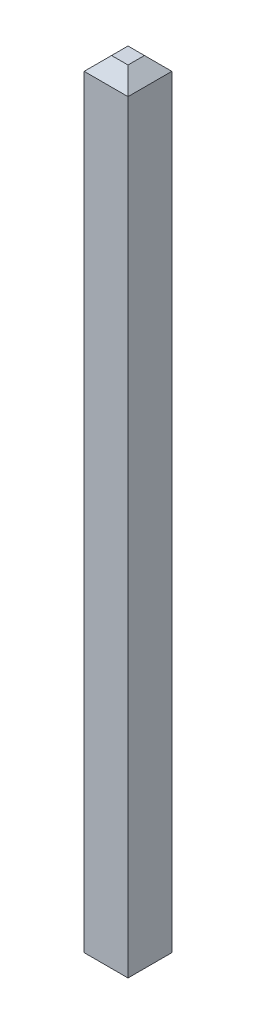
ISO-10303-21;
HEADER;
FILE_DESCRIPTION(('STEP AP214'),'2;1');
FILE_NAME('part.step','',(''),(''),'','','');
FILE_SCHEMA(('AUTOMOTIVE_DESIGN { 1 0 10303 214 1 1 1 1 }'));
ENDSEC;
DATA;
#1=APPLICATION_CONTEXT('core data for automotive mechanical design processes');
#2=APPLICATION_PROTOCOL_DEFINITION('international standard','automotive_design',2000,#1);
#3=PRODUCT_CONTEXT('',#1,'mechanical');
#4=PRODUCT('Part','Part','',(#3));
#5=PRODUCT_RELATED_PRODUCT_CATEGORY('part','',(#4));
#6=PRODUCT_DEFINITION_FORMATION('','',#4);
#7=PRODUCT_DEFINITION_CONTEXT('part definition',#1,'design');
#8=PRODUCT_DEFINITION('design','',#6,#7);
#9=PRODUCT_DEFINITION_SHAPE('','',#8);
#10=(LENGTH_UNIT() NAMED_UNIT(*) SI_UNIT(.MILLI.,.METRE.));
#11=(NAMED_UNIT(*) PLANE_ANGLE_UNIT() SI_UNIT($,.RADIAN.));
#12=(NAMED_UNIT(*) SI_UNIT($,.STERADIAN.) SOLID_ANGLE_UNIT());
#13=UNCERTAINTY_MEASURE_WITH_UNIT(LENGTH_MEASURE(1.E-05),#10,'distance_accuracy_value','');
#14=(GEOMETRIC_REPRESENTATION_CONTEXT(3) GLOBAL_UNCERTAINTY_ASSIGNED_CONTEXT((#13)) GLOBAL_UNIT_ASSIGNED_CONTEXT((#10,
#11,#12)) REPRESENTATION_CONTEXT('',''));
#15=CARTESIAN_POINT('',(0.,0.,0.));
#16=DIRECTION('',(0.,0.,1.));
#17=DIRECTION('',(1.,0.,0.));
#18=AXIS2_PLACEMENT_3D('',#15,#16,#17);
#19=CARTESIAN_POINT('',(-6.03,7.07,-0.32));
#20=DIRECTION('',(-0.707106781186548,-0.707106781186548,0.));
#21=DIRECTION('',(-0.707106781186548,0.707106781186548,0.));
#22=AXIS2_PLACEMENT_3D('',#19,#20,#21);
#23=PLANE('',#22);
#24=DIRECTION('',(0.577350269189626,-0.577350269189626,0.577350269189626));
#25=VECTOR('',#24,1.);
#26=CARTESIAN_POINT('',(-6.243333333333,7.283333333333,0.106666666667));
#27=LINE('',#26,#25);
#28=CARTESIAN_POINT('',(-6.23,7.27,0.12));
#29=VERTEX_POINT('',#28);
#30=CARTESIAN_POINT('',(-6.03,7.07,0.32));
#31=VERTEX_POINT('',#30);
#32=EDGE_CURVE('E178',#29,#31,#27,.T.);
#33=ORIENTED_EDGE('',*,*,#32,.T.);
#34=DIRECTION('',(0.,0.,1.));
#35=VECTOR('',#34,1.);
#36=CARTESIAN_POINT('',(-6.03,7.07,-0.32));
#37=LINE('',#36,#35);
#38=CARTESIAN_POINT('',(-6.03,7.07,-0.32));
#39=VERTEX_POINT('',#38);
#40=EDGE_CURVE('E146',#39,#31,#37,.T.);
#41=ORIENTED_EDGE('',*,*,#40,.F.);
#42=DIRECTION('',(0.577350269189626,-0.577350269189626,-0.577350269189626));
#43=VECTOR('',#42,1.);
#44=CARTESIAN_POINT('',(-6.03,7.07,-0.32));
#45=LINE('',#44,#43);
#46=CARTESIAN_POINT('',(-6.23,7.27,-0.12));
#47=VERTEX_POINT('',#46);
#48=EDGE_CURVE('E11',#47,#39,#45,.T.);
#49=ORIENTED_EDGE('',*,*,#48,.F.);
#50=DIRECTION('',(0.,0.,-1.));
#51=VECTOR('',#50,1.);
#52=CARTESIAN_POINT('',(-6.23,7.27,-0.32));
#53=LINE('',#52,#51);
#54=EDGE_CURVE('E155',#29,#47,#53,.T.);
#55=ORIENTED_EDGE('',*,*,#54,.F.);
#56=EDGE_LOOP('',(#33,#41,#49,#55));
#57=FACE_BOUND('',#56,.T.);
#58=ADVANCED_FACE('F16',(#57),#23,.F.);
#59=CARTESIAN_POINT('',(-6.35,7.07,-0.32));
#60=DIRECTION('',(0.,0.707106781186548,-0.707106781186548));
#61=DIRECTION('',(-1.,0.,0.));
#62=AXIS2_PLACEMENT_3D('',#59,#60,#61);
#63=PLANE('',#62);
#64=DIRECTION('',(0.577350269189626,0.577350269189626,0.577350269189626));
#65=VECTOR('',#64,1.);
#66=CARTESIAN_POINT('',(-6.536666666667,7.203333333333,-0.186666666667));
#67=LINE('',#66,#65);
#68=CARTESIAN_POINT('',(-6.67,7.07,-0.32));
#69=VERTEX_POINT('',#68);
#70=CARTESIAN_POINT('',(-6.47,7.27,-0.12));
#71=VERTEX_POINT('',#70);
#72=EDGE_CURVE('E27',#69,#71,#67,.T.);
#73=ORIENTED_EDGE('',*,*,#72,.T.);
#74=DIRECTION('',(-1.,0.,0.));
#75=VECTOR('',#74,1.);
#76=CARTESIAN_POINT('',(-6.67,7.27,-0.12));
#77=LINE('',#76,#75);
#78=EDGE_CURVE('E141',#47,#71,#77,.T.);
#79=ORIENTED_EDGE('',*,*,#78,.F.);
#80=ORIENTED_EDGE('',*,*,#48,.T.);
#81=DIRECTION('',(1.,0.,0.));
#82=VECTOR('',#81,1.);
#83=CARTESIAN_POINT('',(-6.03,7.07,-0.32));
#84=LINE('',#83,#82);
#85=EDGE_CURVE('E206',#69,#39,#84,.T.);
#86=ORIENTED_EDGE('',*,*,#85,.F.);
#87=EDGE_LOOP('',(#73,#79,#80,#86));
#88=FACE_BOUND('',#87,.T.);
#89=ADVANCED_FACE('F217',(#88),#63,.T.);
#90=CARTESIAN_POINT('',(-6.47,7.27,-0.32));
#91=DIRECTION('',(0.707106781186548,-0.707106781186548,0.));
#92=DIRECTION('',(0.,0.,-1.));
#93=AXIS2_PLACEMENT_3D('',#90,#91,#92);
#94=PLANE('',#93);
#95=DIRECTION('',(-0.577350269189626,-0.577350269189626,0.577350269189626));
#96=VECTOR('',#95,1.);
#97=CARTESIAN_POINT('',(-6.536666666667,7.203333333333,0.186666666667));
#98=LINE('',#97,#96);
#99=CARTESIAN_POINT('',(-6.47,7.27,0.12));
#100=VERTEX_POINT('',#99);
#101=CARTESIAN_POINT('',(-6.67,7.07,0.32));
#102=VERTEX_POINT('',#101);
#103=EDGE_CURVE('E41',#100,#102,#98,.T.);
#104=ORIENTED_EDGE('',*,*,#103,.F.);
#105=DIRECTION('',(0.,0.,1.));
#106=VECTOR('',#105,1.);
#107=CARTESIAN_POINT('',(-6.47,7.27,-0.32));
#108=LINE('',#107,#106);
#109=EDGE_CURVE('E20',#71,#100,#108,.T.);
#110=ORIENTED_EDGE('',*,*,#109,.F.);
#111=ORIENTED_EDGE('',*,*,#72,.F.);
#112=DIRECTION('',(0.,0.,-1.));
#113=VECTOR('',#112,1.);
#114=CARTESIAN_POINT('',(-6.67,7.07,-0.32));
#115=LINE('',#114,#113);
#116=EDGE_CURVE('E179',#102,#69,#115,.T.);
#117=ORIENTED_EDGE('',*,*,#116,.F.);
#118=EDGE_LOOP('',(#104,#110,#111,#117));
#119=FACE_BOUND('',#118,.T.);
#120=ADVANCED_FACE('F18',(#119),#94,.F.);
#121=CARTESIAN_POINT('',(-6.67,7.27,0.12));
#122=DIRECTION('',(0.,-0.707106781186548,-0.707106781186548));
#123=DIRECTION('',(0.,-0.707106781186548,0.707106781186548));
#124=AXIS2_PLACEMENT_3D('',#121,#122,#123);
#125=PLANE('',#124);
#126=ORIENTED_EDGE('',*,*,#32,.F.);
#127=DIRECTION('',(1.,0.,0.));
#128=VECTOR('',#127,1.);
#129=CARTESIAN_POINT('',(-6.67,7.27,0.12));
#130=LINE('',#129,#128);
#131=EDGE_CURVE('E195',#100,#29,#130,.T.);
#132=ORIENTED_EDGE('',*,*,#131,.F.);
#133=ORIENTED_EDGE('',*,*,#103,.T.);
#134=DIRECTION('',(-1.,0.,0.));
#135=VECTOR('',#134,1.);
#136=CARTESIAN_POINT('',(-6.35,7.07,0.32));
#137=LINE('',#136,#135);
#138=EDGE_CURVE('E143',#31,#102,#137,.T.);
#139=ORIENTED_EDGE('',*,*,#138,.F.);
#140=EDGE_LOOP('',(#126,#132,#133,#139));
#141=FACE_BOUND('',#140,.T.);
#142=ADVANCED_FACE('F280',(#141),#125,.F.);
#143=CARTESIAN_POINT('',(-6.67,7.27,-0.32));
#144=DIRECTION('',(0.,-1.,0.));
#145=DIRECTION('',(0.,0.,-1.));
#146=AXIS2_PLACEMENT_3D('',#143,#144,#145);
#147=PLANE('',#146);
#148=ORIENTED_EDGE('',*,*,#54,.T.);
#149=ORIENTED_EDGE('',*,*,#78,.T.);
#150=ORIENTED_EDGE('',*,*,#109,.T.);
#151=ORIENTED_EDGE('',*,*,#131,.T.);
#152=EDGE_LOOP('',(#148,#149,#150,#151));
#153=FACE_BOUND('',#152,.T.);
#154=ADVANCED_FACE('F238',(#153),#147,.F.);
#155=CARTESIAN_POINT('',(-6.03,7.27,-0.32));
#156=DIRECTION('',(-1.,0.,0.));
#157=DIRECTION('',(0.,1.,0.));
#158=AXIS2_PLACEMENT_3D('',#155,#156,#157);
#159=PLANE('',#158);
#160=DIRECTION('',(0.,-1.,0.));
#161=VECTOR('',#160,1.);
#162=CARTESIAN_POINT('',(-6.03,7.27,-0.32));
#163=LINE('',#162,#161);
#164=CARTESIAN_POINT('',(-6.03,-4.07,-0.32));
#165=VERTEX_POINT('',#164);
#166=EDGE_CURVE('E186',#39,#165,#163,.T.);
#167=ORIENTED_EDGE('',*,*,#166,.F.);
#168=ORIENTED_EDGE('',*,*,#40,.T.);
#169=DIRECTION('',(0.,-1.,0.));
#170=VECTOR('',#169,1.);
#171=CARTESIAN_POINT('',(-6.03,7.27,0.32));
#172=LINE('',#171,#170);
#173=CARTESIAN_POINT('',(-6.03,-4.07,0.32));
#174=VERTEX_POINT('',#173);
#175=EDGE_CURVE('E147',#31,#174,#172,.T.);
#176=ORIENTED_EDGE('',*,*,#175,.T.);
#177=DIRECTION('',(0.,0.,-1.));
#178=VECTOR('',#177,1.);
#179=CARTESIAN_POINT('',(-6.03,-4.07,-0.32));
#180=LINE('',#179,#178);
#181=EDGE_CURVE('E162',#174,#165,#180,.T.);
#182=ORIENTED_EDGE('',*,*,#181,.T.);
#183=EDGE_LOOP('',(#167,#168,#176,#182));
#184=FACE_BOUND('',#183,.T.);
#185=ADVANCED_FACE('F226',(#184),#159,.F.);
#186=CARTESIAN_POINT('',(-6.35,1.5,0.32));
#187=DIRECTION('',(0.,0.,-1.));
#188=DIRECTION('',(0.,-1.,0.));
#189=AXIS2_PLACEMENT_3D('',#186,#187,#188);
#190=PLANE('',#189);
#191=ORIENTED_EDGE('',*,*,#175,.F.);
#192=ORIENTED_EDGE('',*,*,#138,.T.);
#193=DIRECTION('',(0.,1.,0.));
#194=VECTOR('',#193,1.);
#195=CARTESIAN_POINT('',(-6.67,-4.27,0.32));
#196=LINE('',#195,#194);
#197=CARTESIAN_POINT('',(-6.67,-4.07,0.32));
#198=VERTEX_POINT('',#197);
#199=EDGE_CURVE('E182',#198,#102,#196,.T.);
#200=ORIENTED_EDGE('',*,*,#199,.F.);
#201=DIRECTION('',(1.,0.,0.));
#202=VECTOR('',#201,1.);
#203=CARTESIAN_POINT('',(-6.35,-4.07,0.32));
#204=LINE('',#203,#202);
#205=EDGE_CURVE('E150',#198,#174,#204,.T.);
#206=ORIENTED_EDGE('',*,*,#205,.T.);
#207=EDGE_LOOP('',(#191,#192,#200,#206));
#208=FACE_BOUND('',#207,.T.);
#209=ADVANCED_FACE('F229',(#208),#190,.F.);
#210=CARTESIAN_POINT('',(-6.23,-4.27,-0.32));
#211=DIRECTION('',(-0.707106781186548,0.707106781186548,0.));
#212=DIRECTION('',(0.,0.,1.));
#213=AXIS2_PLACEMENT_3D('',#210,#211,#212);
#214=PLANE('',#213);
#215=DIRECTION('',(-0.577350269189626,-0.577350269189626,0.577350269189626));
#216=VECTOR('',#215,1.);
#217=CARTESIAN_POINT('',(-6.163333333333,-4.203333333333,-0.186666666667));
#218=LINE('',#217,#216);
#219=CARTESIAN_POINT('',(-6.23,-4.27,-0.12));
#220=VERTEX_POINT('',#219);
#221=EDGE_CURVE('E75',#165,#220,#218,.T.);
#222=ORIENTED_EDGE('',*,*,#221,.F.);
#223=ORIENTED_EDGE('',*,*,#181,.F.);
#224=DIRECTION('',(-0.577350269189626,-0.577350269189626,-0.577350269189626));
#225=VECTOR('',#224,1.);
#226=CARTESIAN_POINT('',(-6.376666666667,-4.416666666667,-0.02666666666667));
#227=LINE('',#226,#225);
#228=CARTESIAN_POINT('',(-6.23,-4.27,0.12));
#229=VERTEX_POINT('',#228);
#230=EDGE_CURVE('E63',#174,#229,#227,.T.);
#231=ORIENTED_EDGE('',*,*,#230,.T.);
#232=DIRECTION('',(0.,0.,1.));
#233=VECTOR('',#232,1.);
#234=CARTESIAN_POINT('',(-6.23,-4.27,-0.32));
#235=LINE('',#234,#233);
#236=EDGE_CURVE('E137',#220,#229,#235,.T.);
#237=ORIENTED_EDGE('',*,*,#236,.F.);
#238=EDGE_LOOP('',(#222,#223,#231,#237));
#239=FACE_BOUND('',#238,.T.);
#240=ADVANCED_FACE('F160',(#239),#214,.F.);
#241=CARTESIAN_POINT('',(-6.03,-4.27,0.12));
#242=DIRECTION('',(0.,0.707106781186548,-0.707106781186548));
#243=DIRECTION('',(-1.,0.,0.));
#244=AXIS2_PLACEMENT_3D('',#241,#242,#243);
#245=PLANE('',#244);
#246=ORIENTED_EDGE('',*,*,#230,.F.);
#247=ORIENTED_EDGE('',*,*,#205,.F.);
#248=DIRECTION('',(-0.577350269189626,0.577350269189626,0.577350269189626));
#249=VECTOR('',#248,1.);
#250=CARTESIAN_POINT('',(-6.456666666667,-4.283333333333,0.106666666667));
#251=LINE('',#250,#249);
#252=CARTESIAN_POINT('',(-6.47,-4.27,0.12));
#253=VERTEX_POINT('',#252);
#254=EDGE_CURVE('E151',#253,#198,#251,.T.);
#255=ORIENTED_EDGE('',*,*,#254,.F.);
#256=DIRECTION('',(-1.,0.,0.));
#257=VECTOR('',#256,1.);
#258=CARTESIAN_POINT('',(-6.03,-4.27,0.12));
#259=LINE('',#258,#257);
#260=EDGE_CURVE('E130',#229,#253,#259,.T.);
#261=ORIENTED_EDGE('',*,*,#260,.F.);
#262=EDGE_LOOP('',(#246,#247,#255,#261));
#263=FACE_BOUND('',#262,.T.);
#264=ADVANCED_FACE('F232',(#263),#245,.F.);
#265=CARTESIAN_POINT('',(-6.67,-4.07,-0.32));
#266=DIRECTION('',(0.707106781186548,0.707106781186548,0.));
#267=DIRECTION('',(0.,0.,-1.));
#268=AXIS2_PLACEMENT_3D('',#265,#266,#267);
#269=PLANE('',#268);
#270=DIRECTION('',(0.577350269189626,-0.577350269189626,0.577350269189626));
#271=VECTOR('',#270,1.);
#272=CARTESIAN_POINT('',(-6.563333333333,-4.176666666667,-0.213333333333));
#273=LINE('',#272,#271);
#274=CARTESIAN_POINT('',(-6.67,-4.07,-0.32));
#275=VERTEX_POINT('',#274);
#276=CARTESIAN_POINT('',(-6.47,-4.27,-0.12));
#277=VERTEX_POINT('',#276);
#278=EDGE_CURVE('E112',#275,#277,#273,.T.);
#279=ORIENTED_EDGE('',*,*,#278,.T.);
#280=DIRECTION('',(0.,0.,-1.));
#281=VECTOR('',#280,1.);
#282=CARTESIAN_POINT('',(-6.47,-4.27,-0.32));
#283=LINE('',#282,#281);
#284=EDGE_CURVE('E116',#253,#277,#283,.T.);
#285=ORIENTED_EDGE('',*,*,#284,.F.);
#286=ORIENTED_EDGE('',*,*,#254,.T.);
#287=DIRECTION('',(0.,0.,1.));
#288=VECTOR('',#287,1.);
#289=CARTESIAN_POINT('',(-6.67,-4.07,-0.32));
#290=LINE('',#289,#288);
#291=EDGE_CURVE('E119',#275,#198,#290,.T.);
#292=ORIENTED_EDGE('',*,*,#291,.F.);
#293=EDGE_LOOP('',(#279,#285,#286,#292));
#294=FACE_BOUND('',#293,.T.);
#295=ADVANCED_FACE('F113',(#294),#269,.F.);
#296=CARTESIAN_POINT('',(-6.67,-4.27,-0.32));
#297=DIRECTION('',(1.,0.,0.));
#298=DIRECTION('',(0.,0.,1.));
#299=AXIS2_PLACEMENT_3D('',#296,#297,#298);
#300=PLANE('',#299);
#301=ORIENTED_EDGE('',*,*,#199,.T.);
#302=ORIENTED_EDGE('',*,*,#116,.T.);
#303=DIRECTION('',(0.,1.,0.));
#304=VECTOR('',#303,1.);
#305=CARTESIAN_POINT('',(-6.67,-4.27,-0.32));
#306=LINE('',#305,#304);
#307=EDGE_CURVE('E165',#275,#69,#306,.T.);
#308=ORIENTED_EDGE('',*,*,#307,.F.);
#309=ORIENTED_EDGE('',*,*,#291,.T.);
#310=EDGE_LOOP('',(#301,#302,#308,#309));
#311=FACE_BOUND('',#310,.T.);
#312=ADVANCED_FACE('F234',(#311),#300,.F.);
#313=CARTESIAN_POINT('',(-6.35,1.5,-0.32));
#314=DIRECTION('',(0.,0.,-1.));
#315=DIRECTION('',(0.,-1.,0.));
#316=AXIS2_PLACEMENT_3D('',#313,#314,#315);
#317=PLANE('',#316);
#318=ORIENTED_EDGE('',*,*,#307,.T.);
#319=ORIENTED_EDGE('',*,*,#85,.T.);
#320=ORIENTED_EDGE('',*,*,#166,.T.);
#321=DIRECTION('',(-1.,0.,0.));
#322=VECTOR('',#321,1.);
#323=CARTESIAN_POINT('',(-6.67,-4.07,-0.32));
#324=LINE('',#323,#322);
#325=EDGE_CURVE('E122',#165,#275,#324,.T.);
#326=ORIENTED_EDGE('',*,*,#325,.T.);
#327=EDGE_LOOP('',(#318,#319,#320,#326));
#328=FACE_BOUND('',#327,.T.);
#329=ADVANCED_FACE('F214',(#328),#317,.T.);
#330=CARTESIAN_POINT('',(-6.35,-4.07,-0.32));
#331=DIRECTION('',(0.,-0.707106781186548,-0.707106781186548));
#332=DIRECTION('',(0.,-0.707106781186548,0.707106781186548));
#333=AXIS2_PLACEMENT_3D('',#330,#331,#332);
#334=PLANE('',#333);
#335=ORIENTED_EDGE('',*,*,#278,.F.);
#336=ORIENTED_EDGE('',*,*,#325,.F.);
#337=ORIENTED_EDGE('',*,*,#221,.T.);
#338=DIRECTION('',(1.,0.,0.));
#339=VECTOR('',#338,1.);
#340=CARTESIAN_POINT('',(-6.03,-4.27,-0.12));
#341=LINE('',#340,#339);
#342=EDGE_CURVE('E123',#277,#220,#341,.T.);
#343=ORIENTED_EDGE('',*,*,#342,.F.);
#344=EDGE_LOOP('',(#335,#336,#337,#343));
#345=FACE_BOUND('',#344,.T.);
#346=ADVANCED_FACE('F125',(#345),#334,.T.);
#347=CARTESIAN_POINT('',(-6.03,-4.27,-0.32));
#348=DIRECTION('',(0.,1.,0.));
#349=DIRECTION('',(0.,0.,-1.));
#350=AXIS2_PLACEMENT_3D('',#347,#348,#349);
#351=PLANE('',#350);
#352=ORIENTED_EDGE('',*,*,#236,.T.);
#353=ORIENTED_EDGE('',*,*,#260,.T.);
#354=ORIENTED_EDGE('',*,*,#284,.T.);
#355=ORIENTED_EDGE('',*,*,#342,.T.);
#356=EDGE_LOOP('',(#352,#353,#354,#355));
#357=FACE_BOUND('',#356,.T.);
#358=ADVANCED_FACE('F129',(#357),#351,.F.);
#359=CLOSED_SHELL('',(#58,#89,#120,#142,#154,#185,#209,#240,#264,#295,#312,#329,#346,#358));
#360=MANIFOLD_SOLID_BREP('B1',#359);
#361=ADVANCED_BREP_SHAPE_REPRESENTATION('',(#18,#360),#14);
#362=SHAPE_DEFINITION_REPRESENTATION(#9,#361);
ENDSEC;
END-ISO-10303-21;
